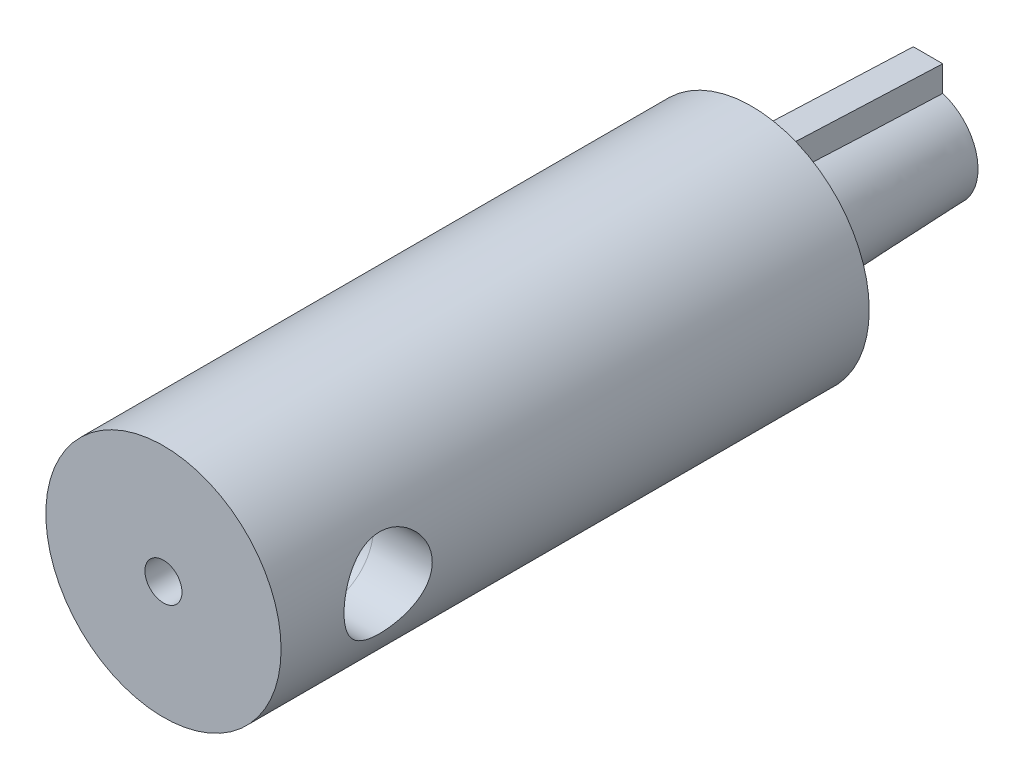
ISO-10303-21;
HEADER;
FILE_DESCRIPTION(('STEP AP214'),'2;1');
FILE_NAME('part.step','',(''),(''),'','','');
FILE_SCHEMA(('AUTOMOTIVE_DESIGN { 1 0 10303 214 1 1 1 1 }'));
ENDSEC;
DATA;
#1=APPLICATION_CONTEXT('core data for automotive mechanical design processes');
#2=APPLICATION_PROTOCOL_DEFINITION('international standard','automotive_design',2000,#1);
#3=PRODUCT_CONTEXT('',#1,'mechanical');
#4=PRODUCT('Part','Part','',(#3));
#5=PRODUCT_RELATED_PRODUCT_CATEGORY('part','',(#4));
#6=PRODUCT_DEFINITION_FORMATION('','',#4);
#7=PRODUCT_DEFINITION_CONTEXT('part definition',#1,'design');
#8=PRODUCT_DEFINITION('design','',#6,#7);
#9=PRODUCT_DEFINITION_SHAPE('','',#8);
#10=(LENGTH_UNIT() NAMED_UNIT(*) SI_UNIT(.MILLI.,.METRE.));
#11=(NAMED_UNIT(*) PLANE_ANGLE_UNIT() SI_UNIT($,.RADIAN.));
#12=(NAMED_UNIT(*) SI_UNIT($,.STERADIAN.) SOLID_ANGLE_UNIT());
#13=UNCERTAINTY_MEASURE_WITH_UNIT(LENGTH_MEASURE(1.E-05),#10,'distance_accuracy_value','');
#14=(GEOMETRIC_REPRESENTATION_CONTEXT(3) GLOBAL_UNCERTAINTY_ASSIGNED_CONTEXT((#13)) GLOBAL_UNIT_ASSIGNED_CONTEXT((#10,
#11,#12)) REPRESENTATION_CONTEXT('',''));
#15=CARTESIAN_POINT('',(0.,0.,0.));
#16=DIRECTION('',(0.,0.,1.));
#17=DIRECTION('',(1.,0.,0.));
#18=AXIS2_PLACEMENT_3D('',#15,#16,#17);
#19=CARTESIAN_POINT('',(3.30208634636661,-7.83238314698274,-30.));
#20=CARTESIAN_POINT('',(5.6762524053336,-7.92733616235268,0.));
#21=CARTESIAN_POINT('',(18.9668526403321,-1.22821045424952,-30.));
#22=CARTESIAN_POINT('',(21.530924730039,3.42516864831451,0.));
#23=CARTESIAN_POINT('',(12.3626799475989,14.436555839716,-30.));
#24=CARTESIAN_POINT('',(10.1784199193718,19.2798409730199,0.));
#25=CARTESIAN_POINT('',(-3.30208634636661,7.83238314698274,-30.));
#26=CARTESIAN_POINT('',(-5.6762524053336,7.92733616235268,0.));
#27=CARTESIAN_POINT('',(-18.9668526403321,1.22821045424951,-30.));
#28=CARTESIAN_POINT('',(-21.530924730039,-3.42516864831451,0.));
#29=CARTESIAN_POINT('',(-12.3626799475989,-14.436555839716,-30.));
#30=CARTESIAN_POINT('',(-10.1784199193718,-19.2798409730199,0.));
#31=CARTESIAN_POINT('',(3.30208634636661,-7.83238314698274,-30.));
#32=CARTESIAN_POINT('',(5.6762524053336,-7.92733616235268,0.));
#33=(BOUNDED_SURFACE() B_SPLINE_SURFACE(3,1,((#19,#20),(#21,#22),(#23,#24),(#25,#26),(#27,#28),
(#29,#30),(#31,#32)),.UNSPECIFIED.,.T.,.F.,.F.) B_SPLINE_SURFACE_WITH_KNOTS((4,3,4),(2,2),(0.,
0.5,1.),(0.,1.),.UNSPECIFIED.) GEOMETRIC_REPRESENTATION_ITEM() RATIONAL_B_SPLINE_SURFACE(((1.,
1.),(0.333333333333333,0.333333333333333),(0.333333333333333,0.333333333333333),(1.,1.),
(0.333333333333333,0.333333333333333),(0.333333333333333,0.333333333333333),(1.,1.))) REPRESENTATION_ITEM('') SURFACE());
#34=CARTESIAN_POINT('',(-9.41145667145274,-2.54695569678151,0.));
#35=CARTESIAN_POINT('',(-9.2880696524457,-2.4757181681433,-2.83135772601338));
#36=CARTESIAN_POINT('',(-9.1687625736273,-2.40683619407127,-5.66295938255184));
#37=CARTESIAN_POINT('',(-8.93959445864397,-2.27452592119596,-11.3266726984917));
#38=CARTESIAN_POINT('',(-8.82973342694787,-2.21109762497277,-14.1587843581338));
#39=CARTESIAN_POINT('',(-8.64526098561574,-2.1045924113116,-19.15898570479));
#40=CARTESIAN_POINT('',(-8.56842689083375,-2.06023222600628,-21.3269657384203));
#41=CARTESIAN_POINT('',(-8.42167777167353,-1.97550658255578,-25.6632449497094));
#42=CARTESIAN_POINT('',(-8.3517627708245,-1.9351411379952,-27.8315441284285));
#43=CARTESIAN_POINT('',(-8.28562363973516,-1.8969556928568,-30.));
#44=B_SPLINE_CURVE_WITH_KNOTS('',3,(#34,#35,#36,#37,#38,#39,#40,#41,#42,#43),.UNSPECIFIED.,.F.,
.F.,(4,2,2,2,4),(0.,8.5048271624319,17.0096583484011,23.5190281215728,30.0284200298795),.UNSPECIFIED.);
#45=CARTESIAN_POINT('',(-9.41145667145274,-2.54695569678151,0.));
#46=VERTEX_POINT('',#45);
#47=CARTESIAN_POINT('',(-8.28562460028441,-1.89695591273358,-30.));
#48=VERTEX_POINT('',#47);
#49=EDGE_CURVE('E12',#46,#48,#44,.T.);
#50=CARTESIAN_POINT('',(0.,0.,0.));
#51=DIRECTION('',(0.,0.,-1.));
#52=DIRECTION('',(-1.,0.,0.));
#53=AXIS2_PLACEMENT_3D('',#50,#51,#52);
#54=CIRCLE('',#53,9.75);
#55=CARTESIAN_POINT('',(-2.5,9.42403841248538,0.));
#56=VERTEX_POINT('',#55);
#57=EDGE_CURVE('E371',#46,#56,#54,.T.);
#58=CARTESIAN_POINT('',(-2.5,8.12403840463597,-29.9999999999999));
#59=CARTESIAN_POINT('',(-2.50000000000011,8.2238309010352,-27.1668030299867));
#60=CARTESIAN_POINT('',(-2.50000000000006,8.33105010057489,-24.3338753056638));
#61=CARTESIAN_POINT('',(-2.49999999999993,8.55874924063093,-18.6685535280623));
#62=CARTESIAN_POINT('',(-2.49999999999985,8.6792291720726,-15.8361594744197));
#63=CARTESIAN_POINT('',(-2.49999999999988,8.90222062843687,-10.8363895040832));
#64=CARTESIAN_POINT('',(-2.49999999999995,9.00231564568361,-8.66890486456372));
#65=CARTESIAN_POINT('',(-2.50000000000005,9.20869572257075,-4.33423326601074));
#66=CARTESIAN_POINT('',(-2.50000000000008,9.31498077289041,-2.16704630653393));
#67=CARTESIAN_POINT('',(-2.5,9.42403841248538,0.));
#68=B_SPLINE_CURVE_WITH_KNOTS('',3,(#58,#59,#60,#61,#62,#63,#64,#65,#66,#67),.UNSPECIFIED.,.F.,
.F.,(4,2,2,2,4),(0.,8.50484125893351,17.0096766978059,23.5190522242231,30.0284179493096),.UNSPECIFIED.);
#69=CARTESIAN_POINT('',(-2.49999976575404,8.12403764358966,-30.));
#70=VERTEX_POINT('',#69);
#71=EDGE_CURVE('E379',#70,#56,#68,.T.);
#72=CARTESIAN_POINT('',(0.,0.,-30.));
#73=DIRECTION('',(0.,0.,1.));
#74=DIRECTION('',(1.,0.,0.));
#75=AXIS2_PLACEMENT_3D('',#72,#73,#74);
#76=CIRCLE('',#75,8.5);
#77=EDGE_CURVE('E326',#70,#48,#76,.T.);
#78=ORIENTED_EDGE('',*,*,#49,.F.);
#79=ORIENTED_EDGE('',*,*,#57,.T.);
#80=ORIENTED_EDGE('',*,*,#71,.F.);
#81=ORIENTED_EDGE('',*,*,#77,.T.);
#82=EDGE_LOOP('',(#78,#79,#80,#81));
#83=FACE_BOUND('',#82,.T.);
#84=ADVANCED_FACE('F53',(#83),#33,.T.);
#85=CARTESIAN_POINT('',(0.,0.,100.));
#86=DIRECTION('',(0.,0.,-1.));
#87=DIRECTION('',(-1.,0.,0.));
#88=AXIS2_PLACEMENT_3D('',#85,#86,#87);
#89=CYLINDRICAL_SURFACE('',#88,20.);
#90=CARTESIAN_POINT('',(0.,0.,100.));
#91=DIRECTION('',(0.,0.,1.));
#92=DIRECTION('',(1.,0.,0.));
#93=AXIS2_PLACEMENT_3D('',#90,#91,#92);
#94=CIRCLE('',#93,20.);
#95=CARTESIAN_POINT('',(20.,0.,100.));
#96=VERTEX_POINT('',#95);
#97=EDGE_CURVE('E421',#96,#96,#94,.T.);
#98=ORIENTED_EDGE('',*,*,#97,.F.);
#99=EDGE_LOOP('',(#98));
#100=FACE_BOUND('',#99,.T.);
#101=CARTESIAN_POINT('',(0.,0.,0.));
#102=DIRECTION('',(0.,0.,1.));
#103=DIRECTION('',(1.,0.,0.));
#104=AXIS2_PLACEMENT_3D('',#101,#102,#103);
#105=CIRCLE('',#104,20.);
#106=CARTESIAN_POINT('',(20.,0.,0.));
#107=VERTEX_POINT('',#106);
#108=EDGE_CURVE('E419',#107,#107,#105,.T.);
#109=ORIENTED_EDGE('',*,*,#108,.T.);
#110=EDGE_LOOP('',(#109));
#111=FACE_BOUND('',#110,.T.);
#112=CARTESIAN_POINT('',(20.,0.,74.2938834486489));
#113=CARTESIAN_POINT('',(20.0000006949911,0.203070968021459,74.2938825011936));
#114=CARTESIAN_POINT('',(19.9969005176281,0.406128872036972,74.3021372739096));
#115=CARTESIAN_POINT('',(19.9845861075051,0.810722493053342,74.3350686721892));
#116=CARTESIAN_POINT('',(19.9753719932571,1.01225823948296,74.3597449794395));
#117=CARTESIAN_POINT('',(19.9510804699548,1.41228165684716,74.4252652052667));
#118=CARTESIAN_POINT('',(19.9360041221055,1.61076987270177,74.4661061976716));
#119=CARTESIAN_POINT('',(19.9003893947718,2.00333465937662,74.5635616330823));
#120=CARTESIAN_POINT('',(19.8798508703887,2.19741111301496,74.6201764945335));
#121=CARTESIAN_POINT('',(19.8338980424643,2.57942334484994,74.7485238813045));
#122=CARTESIAN_POINT('',(19.8084943914583,2.76737150814739,74.8202234108822));
#123=CARTESIAN_POINT('',(19.7534187407954,3.13644330297231,74.9782370976797));
#124=CARTESIAN_POINT('',(19.7237452567773,3.31756453344304,75.0645563391395));
#125=CARTESIAN_POINT('',(19.6608785037209,3.67181392735243,75.2511124295837));
#126=CARTESIAN_POINT('',(19.6276857148228,3.84494317652612,75.3513473806179));
#127=CARTESIAN_POINT('',(19.5585744043947,4.18232397222971,75.5650745947781));
#128=CARTESIAN_POINT('',(19.5226549005367,4.34657228246888,75.6785716437325));
#129=CARTESIAN_POINT('',(19.4475600773382,4.67132012701298,75.9226330219386));
#130=CARTESIAN_POINT('',(19.4083128458309,4.83143819793328,76.0536829700604));
#131=CARTESIAN_POINT('',(19.328838303106,5.14017756215578,76.3284211117974));
#132=CARTESIAN_POINT('',(19.2886109633058,5.28879851964385,76.4721096743065));
#133=CARTESIAN_POINT('',(19.2082062022255,5.57375496212915,76.771338402275));
#134=CARTESIAN_POINT('',(19.1680288125827,5.71008474111935,76.9268840109929));
#135=CARTESIAN_POINT('',(19.0888249186339,5.96951895886719,77.2488237377724));
#136=CARTESIAN_POINT('',(19.0497980301105,6.09262784997175,77.4152141731386));
#137=CARTESIAN_POINT('',(18.9724859555749,6.32936647954693,77.7645731589389));
#138=CARTESIAN_POINT('',(18.9342875038848,6.44244711735878,77.9479336658511));
#139=CARTESIAN_POINT('',(18.8614640429767,6.65263459332164,78.3241763915298));
#140=CARTESIAN_POINT('',(18.826837602539,6.74974783856143,78.5170547505649));
#141=CARTESIAN_POINT('',(18.7622651010258,6.92721666163355,78.9111145899574));
#142=CARTESIAN_POINT('',(18.732318593607,7.00757383780174,79.1122952761735));
#143=CARTESIAN_POINT('',(18.6781264228347,7.1507665901449,79.5215442571735));
#144=CARTESIAN_POINT('',(18.6538804250933,7.21360319410448,79.7296121471418));
#145=CARTESIAN_POINT('',(18.6128171932609,7.3188864092305,80.1424010878224));
#146=CARTESIAN_POINT('',(18.5957361566855,7.36206332770832,80.3469096454774));
#147=CARTESIAN_POINT('',(18.5682025890409,7.43123437452077,80.7592563383945));
#148=CARTESIAN_POINT('',(18.5577498877569,7.4572289440963,80.9670943880152));
#149=CARTESIAN_POINT('',(18.5438461337811,7.49173666070089,81.3843766904721));
#150=CARTESIAN_POINT('',(18.5403925915472,7.50025602352703,81.5938203455907));
#151=CARTESIAN_POINT('',(18.5406045750876,7.49973228101478,82.0126779142968));
#152=CARTESIAN_POINT('',(18.5442698247326,7.49068985687681,82.2220918287227));
#153=CARTESIAN_POINT('',(18.5581541826773,7.45622070727225,82.6266357949813));
#154=CARTESIAN_POINT('',(18.5679659887167,7.43181178035891,82.8218676270276));
#155=CARTESIAN_POINT('',(18.5934550735589,7.36780931755873,83.2095063094472));
#156=CARTESIAN_POINT('',(18.6091343980122,7.32821048574541,83.4019121502259));
#157=CARTESIAN_POINT('',(18.6458755071589,7.23421503229473,83.7824869262937));
#158=CARTESIAN_POINT('',(18.6669358543613,7.17982236244592,83.9706569785499));
#159=CARTESIAN_POINT('',(18.7138316388318,7.05668780060369,84.3417028520011));
#160=CARTESIAN_POINT('',(18.7396689024681,6.98794041903922,84.5245766172199));
#161=CARTESIAN_POINT('',(18.7959041471208,6.83525595221402,84.8872142462722));
#162=CARTESIAN_POINT('',(18.8263777414694,6.75106109551286,85.0668577612196));
#163=CARTESIAN_POINT('',(18.8906847573172,6.56896880176203,85.4185031761953));
#164=CARTESIAN_POINT('',(18.9245193195636,6.47106670768666,85.5905024528234));
#165=CARTESIAN_POINT('',(18.9946467838013,6.26222988156312,85.925893454014));
#166=CARTESIAN_POINT('',(19.0309399609969,6.15129368952391,86.0892842113338));
#167=CARTESIAN_POINT('',(19.1050600058862,5.91707432475699,86.4065965981358));
#168=CARTESIAN_POINT('',(19.1428869428418,5.79379059406597,86.5605177991976));
#169=CARTESIAN_POINT('',(19.2217192251952,5.52685758549759,86.8681383312753));
#170=CARTESIAN_POINT('',(19.2627668694648,5.38239554850842,87.0211225300534));
#171=CARTESIAN_POINT('',(19.3444196466276,5.08111960259879,87.3144278915546));
#172=CARTESIAN_POINT('',(19.3850249099682,4.9243094535767,87.4547528811928));
#173=CARTESIAN_POINT('',(19.4647378562275,4.59913178437368,87.7219771706626));
#174=CARTESIAN_POINT('',(19.5038447299098,4.4307581524274,87.8488692792245));
#175=CARTESIAN_POINT('',(19.5794735643872,4.08359626326275,88.0882202266966));
#176=CARTESIAN_POINT('',(19.6159965527517,3.90481219826151,88.2006848178338));
#177=CARTESIAN_POINT('',(19.6860423205742,3.53492899562548,88.4120681535395));
#178=CARTESIAN_POINT('',(19.7195078794209,3.34367879554688,88.5107419190484));
#179=CARTESIAN_POINT('',(19.7818042347176,2.95285527289817,88.6914900333154));
#180=CARTESIAN_POINT('',(19.8106369862409,2.75328550625454,88.7735713879671));
#181=CARTESIAN_POINT('',(19.8628434264484,2.34719996217688,88.9204015192833));
#182=CARTESIAN_POINT('',(19.8862178749036,2.14068515604437,88.9851527084115));
#183=CARTESIAN_POINT('',(19.9268153054777,1.72226565642152,89.0966685223494));
#184=CARTESIAN_POINT('',(19.9440386557731,1.5103612863393,89.1434342237007));
#185=CARTESIAN_POINT('',(19.9710730258303,1.09424775972726,89.2164734938672));
#186=CARTESIAN_POINT('',(19.9812295417902,0.890228709079153,89.2437046257716));
#187=CARTESIAN_POINT('',(19.9952797490968,0.480429861153437,89.2813075022969));
#188=CARTESIAN_POINT('',(19.9991736625905,0.274650126591165,89.2916798449332));
#189=CARTESIAN_POINT('',(20.0005896492051,-0.137045616648888,89.2954558724119));
#190=CARTESIAN_POINT('',(19.9981129628774,-0.342961590989924,89.2888628609298));
#191=CARTESIAN_POINT('',(19.9868596574388,-0.75337984881987,89.2587848997777));
#192=CARTESIAN_POINT('',(19.9780831342252,-0.957882153780105,89.2353002072363));
#193=CARTESIAN_POINT('',(19.9549324504254,-1.35605980169529,89.1729165954862));
#194=CARTESIAN_POINT('',(19.9407879695859,-1.54984794134557,89.1346491234203));
#195=CARTESIAN_POINT('',(19.9072569807347,-1.93344269290831,89.0430693283587));
#196=CARTESIAN_POINT('',(19.887868626756,-2.1232478773237,88.9897517070662));
#197=CARTESIAN_POINT('',(19.8443406080703,-2.49752579570185,88.8685600525246));
#198=CARTESIAN_POINT('',(19.8202022917965,-2.68200002602577,88.8006901499308));
#199=CARTESIAN_POINT('',(19.7677484774414,-3.04461799000738,88.6509090496575));
#200=CARTESIAN_POINT('',(19.7394313942141,-3.22275928941149,88.5689925217043));
#201=CARTESIAN_POINT('',(19.6784277420874,-3.57668241852781,88.3891754419566));
#202=CARTESIAN_POINT('',(19.6456382523032,-3.75224591151486,88.2908801609634));
#203=CARTESIAN_POINT('',(19.5771555886676,-4.09456511700747,88.0807655174246));
#204=CARTESIAN_POINT('',(19.5414614186652,-4.26131777525404,87.9689415087907));
#205=CARTESIAN_POINT('',(19.4680439258145,-4.58506525872597,87.7325162883983));
#206=CARTESIAN_POINT('',(19.4303203062301,-4.74205864972659,87.6079132057198));
#207=CARTESIAN_POINT('',(19.3537631643409,-5.04542669379828,87.3466971694549));
#208=CARTESIAN_POINT('',(19.3149296015203,-5.19180095855238,87.2100837770827));
#209=CARTESIAN_POINT('',(19.2348304666649,-5.4813462403016,86.9173256371552));
#210=CARTESIAN_POINT('',(19.1935550246388,-5.62383372222469,86.7605066744072));
#211=CARTESIAN_POINT('',(19.1119813103232,-5.89510225689365,86.4352836362986));
#212=CARTESIAN_POINT('',(19.071682729132,-6.02388768732424,86.2668832895691));
#213=CARTESIAN_POINT('',(18.9931802921809,-6.26701151435384,85.9193600322703));
#214=CARTESIAN_POINT('',(18.9549774947293,-6.38134264929433,85.7402317982143));
#215=CARTESIAN_POINT('',(18.881842233177,-6.59459943128484,85.3724887289153));
#216=CARTESIAN_POINT('',(18.8469083964192,-6.69353155615769,85.1838779270717));
#217=CARTESIAN_POINT('',(18.7812317544015,-6.87566403749446,84.7973959804677));
#218=CARTESIAN_POINT('',(18.7505091923228,-6.95878910381581,84.5994858541344));
#219=CARTESIAN_POINT('',(18.694480634226,-7.10793535121494,84.1966649688911));
#220=CARTESIAN_POINT('',(18.6691723687546,-7.17396370099289,83.9917571850453));
#221=CARTESIAN_POINT('',(18.6248465673625,-7.28826820106416,83.5764429068598));
#222=CARTESIAN_POINT('',(18.6058271216825,-7.33654974112424,83.3660381028109));
#223=CARTESIAN_POINT('',(18.5747639414794,-7.41484504718195,82.9413522612139));
#224=CARTESIAN_POINT('',(18.5627197204411,-7.44486008725788,82.7270714950858));
#225=CARTESIAN_POINT('',(18.5465933049917,-7.48493863022116,82.3102824551219));
#226=CARTESIAN_POINT('',(18.5420491539834,-7.4961604056798,82.1079026474111));
#227=CARTESIAN_POINT('',(18.5396138019941,-7.5021819174978,81.7028610146104));
#228=CARTESIAN_POINT('',(18.5417223790381,-7.49698220177711,81.5001991991556));
#229=CARTESIAN_POINT('',(18.5525209844085,-7.4702189157973,81.0961592525601));
#230=CARTESIAN_POINT('',(18.5612103739758,-7.44865693372293,80.8947809987448));
#231=CARTESIAN_POINT('',(18.5848804234321,-7.38940016534892,80.4947908378965));
#232=CARTESIAN_POINT('',(18.5998610789405,-7.35170539028268,80.2961789289373));
#233=CARTESIAN_POINT('',(18.6350757989785,-7.26196897505606,79.9091982990506));
#234=CARTESIAN_POINT('',(18.655133955521,-7.21040468493111,79.7207024642879));
#235=CARTESIAN_POINT('',(18.7001191111151,-7.09291899633679,79.3487758547288));
#236=CARTESIAN_POINT('',(18.7250477129692,-7.02699287074365,79.1653467700793));
#237=CARTESIAN_POINT('',(18.7790659217203,-6.88133055609669,78.8047213581384));
#238=CARTESIAN_POINT('',(18.8081548517944,-6.80159661292323,78.6275240228659));
#239=CARTESIAN_POINT('',(18.8697152850299,-6.62889488784757,78.2802804431833));
#240=CARTESIAN_POINT('',(18.9021880991186,-6.53592197197538,78.1102370062944));
#241=CARTESIAN_POINT('',(19.0069536143875,-6.2277137240126,77.5949563578366));
#242=CARTESIAN_POINT('',(19.0836670851801,-5.99071861556498,77.2633181287321));
#243=CARTESIAN_POINT('',(19.2403301804045,-5.46664728657928,76.643086951488));
#244=CARTESIAN_POINT('',(19.3202808271434,-5.17955514905406,76.3545077384175));
#245=CARTESIAN_POINT('',(19.438676663767,-4.70809408633241,75.9518132678851));
#246=CARTESIAN_POINT('',(19.4788882496359,-4.53926103129734,75.8196777789076));
#247=CARTESIAN_POINT('',(19.55686920485,-4.19055225393182,75.5701237126359));
#248=CARTESIAN_POINT('',(19.5946394801554,-4.01068067682134,75.4526996606322));
#249=CARTESIAN_POINT('',(19.6667051020052,-3.6409088062972,75.2333937635382));
#250=CARTESIAN_POINT('',(19.7009985836445,-3.45100321297443,75.131520244886));
#251=CARTESIAN_POINT('',(19.7651027001156,-3.06258638682355,74.9442834146511));
#252=CARTESIAN_POINT('',(19.7949152332913,-2.86407884437145,74.8589131071087));
#253=CARTESIAN_POINT('',(19.8503942615567,-2.45094825989374,74.7020731372954));
#254=CARTESIAN_POINT('',(19.8758228421911,-2.23600002200006,74.6313733309101));
#255=CARTESIAN_POINT('',(19.9200461241093,-1.79994016793749,74.5095535387856));
#256=CARTESIAN_POINT('',(19.9388404924467,-1.57882824303678,74.4584345357231));
#257=CARTESIAN_POINT('',(19.969163307367,-1.13248745661206,74.3764083396845));
#258=CARTESIAN_POINT('',(19.9806948101893,-0.907260367875009,74.345492644879));
#259=CARTESIAN_POINT('',(19.9961123363293,-0.454683233786637,74.30423188976));
#260=CARTESIAN_POINT('',(19.9999992219729,-0.227333430788376,74.293884509304));
#261=CARTESIAN_POINT('',(20.,0.,74.2938834486489));
#262=B_SPLINE_CURVE_WITH_KNOTS('',3,(#112,#113,#114,#115,#116,#117,#118,#119,#120,#121,#122,
#123,#124,#125,#126,#127,#128,#129,#130,#131,#132,#133,#134,#135,#136,#137,#138,#139,#140,#141,
#142,#143,#144,#145,#146,#147,#148,#149,#150,#151,#152,#153,#154,#155,#156,#157,#158,#159,#160,
#161,#162,#163,#164,#165,#166,#167,#168,#169,#170,#171,#172,#173,#174,#175,#176,#177,#178,#179,
#180,#181,#182,#183,#184,#185,#186,#187,#188,#189,#190,#191,#192,#193,#194,#195,#196,#197,#198,
#199,#200,#201,#202,#203,#204,#205,#206,#207,#208,#209,#210,#211,#212,#213,#214,#215,#216,#217,
#218,#219,#220,#221,#222,#223,#224,#225,#226,#227,#228,#229,#230,#231,#232,#233,#234,#235,#236,
#237,#238,#239,#240,#241,#242,#243,#244,#245,#246,#247,#248,#249,#250,#251,#252,#253,#254,#255,
#256,#257,#258,#259,#260,#261),.UNSPECIFIED.,.T.,.F.,(4,2,2,2,2,2,2,2,2,2,2,2,2,2,2,2,2,2,2,2,2,
2,2,2,2,2,2,2,2,2,2,2,2,2,2,2,2,2,2,2,2,2,2,2,2,2,2,2,2,2,2,2,2,2,2,2,2,2,2,2,2,2,2,2,2,2,2,2,2,
2,2,2,2,2,4),(0.,0.608999956569121,1.2179881086895,1.82686607061669,2.43576018624771,
3.04333602101901,3.65112358554747,4.25882833580728,4.86675306673733,5.49784759802492,
6.12896055572049,6.76036500614003,7.39155614970225,8.04710389078631,8.70238794089193,
9.35760945582954,10.0127925263413,10.6411154155012,11.2694221687695,11.8975053993619,
12.5255642678541,13.1158609555577,13.706363636216,14.2967087341194,14.8872800083734,
15.48879042923,16.0905057110534,16.6922884573043,17.294098409327,17.9364976383173,
18.5787020128302,19.2212484699716,19.8635379434159,20.5160836111604,21.1683531732238,
21.8205318881423,22.4726715600923,23.0901283371345,23.7075632112555,24.3248778609402,
24.9421831139336,25.5356078324118,26.129241722893,26.7227073333315,27.3163986465876,
27.9273114640636,28.5384346823473,29.149647500183,29.760882657408,30.407730978247,
31.0543720122049,31.7013366304338,32.3480283535228,32.9977271255338,33.647153034297,
34.2963815469097,34.9455647710003,35.5530262644448,36.1604674895258,36.7678497615569,
37.375231610664,37.96391674576,38.5527959370655,39.1415794353244,39.7305918841889,
40.9691711455771,42.2081446512166,42.8618687687023,43.5153488822951,44.169177679639,
44.8227286983722,45.5048205241399,46.186946576693,46.8687853960765,47.5505472984583),.UNSPECIFIED.);
#263=CARTESIAN_POINT('',(20.,0.,74.2938834486489));
#264=VERTEX_POINT('',#263);
#265=EDGE_CURVE('E425',#264,#264,#262,.T.);
#266=ORIENTED_EDGE('',*,*,#265,.F.);
#267=EDGE_LOOP('',(#266));
#268=FACE_BOUND('',#267,.T.);
#269=ADVANCED_FACE('F55',(#100,#111,#268),#89,.T.);
#270=CARTESIAN_POINT('',(0.,0.,100.));
#271=DIRECTION('',(0.,0.,1.));
#272=DIRECTION('',(1.,0.,0.));
#273=AXIS2_PLACEMENT_3D('',#270,#271,#272);
#274=PLANE('',#273);
#275=CARTESIAN_POINT('',(0.,0.,100.));
#276=DIRECTION('',(0.,0.,1.));
#277=DIRECTION('',(1.,0.,0.));
#278=AXIS2_PLACEMENT_3D('',#275,#276,#277);
#279=CIRCLE('',#278,3.15);
#280=CARTESIAN_POINT('',(3.15,0.,100.));
#281=VERTEX_POINT('',#280);
#282=EDGE_CURVE('E428',#281,#281,#279,.T.);
#283=ORIENTED_EDGE('',*,*,#282,.F.);
#284=EDGE_LOOP('',(#283));
#285=FACE_BOUND('',#284,.T.);
#286=ORIENTED_EDGE('',*,*,#97,.T.);
#287=EDGE_LOOP('',(#286));
#288=FACE_BOUND('',#287,.T.);
#289=ADVANCED_FACE('F416',(#285,#288),#274,.T.);
#290=CARTESIAN_POINT('',(0.,0.,0.));
#291=DIRECTION('',(0.,0.,1.));
#292=DIRECTION('',(1.,0.,0.));
#293=AXIS2_PLACEMENT_3D('',#290,#291,#292);
#294=PLANE('',#293);
#295=ORIENTED_EDGE('',*,*,#57,.F.);
#296=DIRECTION('',(0.866025403784443,0.499999999999992,0.));
#297=VECTOR('',#296,1.);
#298=CARTESIAN_POINT('',(-13.1578493020361,-4.70993649053878,0.));
#299=LINE('',#298,#297);
#300=CARTESIAN_POINT('',(-13.1578493020361,-4.70993649053878,0.));
#301=VERTEX_POINT('',#300);
#302=EDGE_CURVE('E73',#301,#46,#299,.T.);
#303=ORIENTED_EDGE('',*,*,#302,.F.);
#304=DIRECTION('',(-0.499999999999992,0.866025403784443,0.));
#305=VECTOR('',#304,1.);
#306=CARTESIAN_POINT('',(-13.1578493020361,-4.70993649053878,0.));
#307=LINE('',#306,#305);
#308=CARTESIAN_POINT('',(-10.6578493020361,-9.040063509461,0.));
#309=VERTEX_POINT('',#308);
#310=EDGE_CURVE('E78',#309,#301,#307,.T.);
#311=ORIENTED_EDGE('',*,*,#310,.F.);
#312=DIRECTION('',(-0.866025403784443,-0.499999999999992,0.));
#313=VECTOR('',#312,1.);
#314=CARTESIAN_POINT('',(-10.6578493020361,-9.040063509461,0.));
#315=LINE('',#314,#313);
#316=CARTESIAN_POINT('',(-6.91145667145279,-6.87708271570373,0.));
#317=VERTEX_POINT('',#316);
#318=EDGE_CURVE('E155',#317,#309,#315,.T.);
#319=ORIENTED_EDGE('',*,*,#318,.F.);
#320=CARTESIAN_POINT('',(2.5,9.42403841248538,0.));
#321=VERTEX_POINT('',#320);
#322=EDGE_CURVE('E328',#321,#317,#54,.T.);
#323=ORIENTED_EDGE('',*,*,#322,.F.);
#324=DIRECTION('',(0.,-1.,0.));
#325=VECTOR('',#324,1.);
#326=CARTESIAN_POINT('',(2.5,13.75,0.));
#327=LINE('',#326,#325);
#328=CARTESIAN_POINT('',(2.5,13.75,0.));
#329=VERTEX_POINT('',#328);
#330=EDGE_CURVE('E295',#329,#321,#327,.T.);
#331=ORIENTED_EDGE('',*,*,#330,.F.);
#332=DIRECTION('',(1.,0.,0.));
#333=VECTOR('',#332,1.);
#334=CARTESIAN_POINT('',(2.5,13.75,0.));
#335=LINE('',#334,#333);
#336=CARTESIAN_POINT('',(-2.5,13.75,0.));
#337=VERTEX_POINT('',#336);
#338=EDGE_CURVE('E404',#337,#329,#335,.T.);
#339=ORIENTED_EDGE('',*,*,#338,.F.);
#340=DIRECTION('',(0.,1.,0.));
#341=VECTOR('',#340,1.);
#342=CARTESIAN_POINT('',(-2.5,13.75,0.));
#343=LINE('',#342,#341);
#344=EDGE_CURVE('E401',#56,#337,#343,.T.);
#345=ORIENTED_EDGE('',*,*,#344,.F.);
#346=EDGE_LOOP('',(#295,#303,#311,#319,#323,#331,#339,#345));
#347=FACE_BOUND('',#346,.T.);
#348=ORIENTED_EDGE('',*,*,#108,.F.);
#349=EDGE_LOOP('',(#348));
#350=FACE_BOUND('',#349,.T.);
#351=ADVANCED_FACE('F412',(#347,#350),#294,.F.);
#352=CARTESIAN_POINT('',(0.,0.,95.));
#353=DIRECTION('',(0.,0.,1.));
#354=DIRECTION('',(1.,0.,0.));
#355=AXIS2_PLACEMENT_3D('',#352,#353,#354);
#356=CYLINDRICAL_SURFACE('',#355,3.15);
#357=CARTESIAN_POINT('',(0.,0.,95.));
#358=DIRECTION('',(0.,0.,1.));
#359=DIRECTION('',(1.,0.,0.));
#360=AXIS2_PLACEMENT_3D('',#357,#358,#359);
#361=CIRCLE('',#360,3.15);
#362=CARTESIAN_POINT('',(3.15,0.,95.));
#363=VERTEX_POINT('',#362);
#364=EDGE_CURVE('E422',#363,#363,#361,.T.);
#365=ORIENTED_EDGE('',*,*,#364,.F.);
#366=EDGE_LOOP('',(#365));
#367=FACE_BOUND('',#366,.T.);
#368=ORIENTED_EDGE('',*,*,#282,.T.);
#369=EDGE_LOOP('',(#368));
#370=FACE_BOUND('',#369,.T.);
#371=ADVANCED_FACE('F415',(#367,#370),#356,.F.);
#372=CARTESIAN_POINT('',(0.,0.,95.));
#373=DIRECTION('',(0.,0.,1.));
#374=DIRECTION('',(1.,0.,0.));
#375=AXIS2_PLACEMENT_3D('',#372,#373,#374);
#376=PLANE('',#375);
#377=ORIENTED_EDGE('',*,*,#364,.T.);
#378=EDGE_LOOP('',(#377));
#379=FACE_BOUND('',#378,.T.);
#380=ADVANCED_FACE('F441',(#379),#376,.T.);
#381=CARTESIAN_POINT('',(9.99999999999999,0.,81.7938834486489));
#382=DIRECTION('',(1.,0.,0.));
#383=DIRECTION('',(0.,0.,-1.));
#384=AXIS2_PLACEMENT_3D('',#381,#382,#383);
#385=CYLINDRICAL_SURFACE('',#384,7.5);
#386=CARTESIAN_POINT('',(9.99999999999999,0.,81.7938834486489));
#387=DIRECTION('',(-1.,0.,0.));
#388=DIRECTION('',(0.,0.,1.));
#389=AXIS2_PLACEMENT_3D('',#386,#387,#388);
#390=CIRCLE('',#389,7.5);
#391=CARTESIAN_POINT('',(9.99999999999999,0.,89.2938834486489));
#392=VERTEX_POINT('',#391);
#393=EDGE_CURVE('E593',#392,#392,#390,.T.);
#394=ORIENTED_EDGE('',*,*,#393,.T.);
#395=EDGE_LOOP('',(#394));
#396=FACE_BOUND('',#395,.T.);
#397=ORIENTED_EDGE('',*,*,#265,.T.);
#398=EDGE_LOOP('',(#397));
#399=FACE_BOUND('',#398,.T.);
#400=ADVANCED_FACE('F435',(#396,#399),#385,.F.);
#401=CARTESIAN_POINT('',(10.,0.,71.7938834486489));
#402=DIRECTION('',(0.,1.,0.));
#403=DIRECTION('',(0.,0.,1.));
#404=AXIS2_PLACEMENT_3D('',#401,#402,#403);
#405=TOROIDAL_SURFACE('',#404,10.,7.5);
#406=CARTESIAN_POINT('',(0.,0.,71.7938834486489));
#407=DIRECTION('',(0.,0.,-1.));
#408=DIRECTION('',(-1.,0.,0.));
#409=AXIS2_PLACEMENT_3D('',#406,#407,#408);
#410=CIRCLE('',#409,7.5);
#411=CARTESIAN_POINT('',(-7.5,0.,71.7938834486489));
#412=VERTEX_POINT('',#411);
#413=EDGE_CURVE('E325',#412,#412,#410,.T.);
#414=CARTESIAN_POINT('',(10.,0.,71.7938834486489));
#415=DIRECTION('',(0.,1.,0.));
#416=DIRECTION('',(0.,0.,1.));
#417=AXIS2_PLACEMENT_3D('',#414,#415,#416);
#418=CIRCLE('',#417,17.5);
#419=EDGE_CURVE('',#412,#392,#418,.T.);
#420=ORIENTED_EDGE('',*,*,#413,.T.);
#421=ORIENTED_EDGE('',*,*,#393,.F.);
#422=ORIENTED_EDGE('',*,*,#419,.T.);
#423=ORIENTED_EDGE('',*,*,#419,.F.);
#424=EDGE_LOOP('',(#420,#422,#421,#423));
#425=FACE_BOUND('',#424,.T.);
#426=ADVANCED_FACE('F440',(#425),#405,.F.);
#427=CARTESIAN_POINT('',(0.,0.,71.7938834486489));
#428=DIRECTION('',(0.,0.,-1.));
#429=DIRECTION('',(-1.,0.,0.));
#430=AXIS2_PLACEMENT_3D('',#427,#428,#429);
#431=CYLINDRICAL_SURFACE('',#430,7.5);
#432=ORIENTED_EDGE('',*,*,#413,.F.);
#433=EDGE_LOOP('',(#432));
#434=FACE_BOUND('',#433,.T.);
#435=CARTESIAN_POINT('',(0.,0.,0.));
#436=DIRECTION('',(0.,0.,-1.));
#437=DIRECTION('',(-1.,0.,0.));
#438=AXIS2_PLACEMENT_3D('',#435,#436,#437);
#439=CIRCLE('',#438,7.5);
#440=CARTESIAN_POINT('',(-7.5,0.,0.));
#441=VERTEX_POINT('',#440);
#442=EDGE_CURVE('E322',#441,#441,#439,.F.);
#443=ORIENTED_EDGE('',*,*,#442,.F.);
#444=EDGE_LOOP('',(#443));
#445=FACE_BOUND('',#444,.T.);
#446=ADVANCED_FACE('F466',(#434,#445),#431,.F.);
#447=CARTESIAN_POINT('',(0.,0.,0.));
#448=DIRECTION('',(0.,0.,-1.));
#449=DIRECTION('',(-1.,0.,0.));
#450=AXIS2_PLACEMENT_3D('',#447,#448,#449);
#451=PLANE('',#450);
#452=CARTESIAN_POINT('',(0.,0.,0.));
#453=DIRECTION('',(0.,0.,-1.));
#454=DIRECTION('',(-1.,0.,0.));
#455=AXIS2_PLACEMENT_3D('',#452,#453,#454);
#456=CIRCLE('',#455,4.);
#457=CARTESIAN_POINT('',(-4.,0.,0.));
#458=VERTEX_POINT('',#457);
#459=EDGE_CURVE('E251',#458,#458,#456,.T.);
#460=ORIENTED_EDGE('',*,*,#459,.T.);
#461=EDGE_LOOP('',(#460));
#462=FACE_BOUND('',#461,.T.);
#463=ORIENTED_EDGE('',*,*,#442,.T.);
#464=EDGE_LOOP('',(#463));
#465=FACE_BOUND('',#464,.T.);
#466=ADVANCED_FACE('F198',(#462,#465),#451,.F.);
#467=CARTESIAN_POINT('',(0.,0.,-30.));
#468=DIRECTION('',(0.,0.,1.));
#469=DIRECTION('',(1.,0.,0.));
#470=AXIS2_PLACEMENT_3D('',#467,#468,#469);
#471=PLANE('',#470);
#472=DIRECTION('',(-0.866025403784443,-0.499999999999992,0.));
#473=VECTOR('',#472,1.);
#474=CARTESIAN_POINT('',(-6.24196809114377,-0.717050611746719,-30.));
#475=LINE('',#474,#473);
#476=CARTESIAN_POINT('',(-12.0753175473055,-4.08493649053879,-30.));
#477=VERTEX_POINT('',#476);
#478=EDGE_CURVE('E150',#48,#477,#475,.T.);
#479=ORIENTED_EDGE('',*,*,#478,.F.);
#480=ORIENTED_EDGE('',*,*,#77,.F.);
#481=DIRECTION('',(0.,-1.,0.));
#482=VECTOR('',#481,1.);
#483=CARTESIAN_POINT('',(-2.5,5.76422824241575,-30.));
#484=LINE('',#483,#482);
#485=CARTESIAN_POINT('',(-2.5,12.5,-30.));
#486=VERTEX_POINT('',#485);
#487=EDGE_CURVE('E229',#486,#70,#484,.T.);
#488=ORIENTED_EDGE('',*,*,#487,.F.);
#489=DIRECTION('',(-1.,0.,0.));
#490=VECTOR('',#489,1.);
#491=CARTESIAN_POINT('',(2.5,12.5,-30.));
#492=LINE('',#491,#490);
#493=CARTESIAN_POINT('',(2.5,12.5,-30.));
#494=VERTEX_POINT('',#493);
#495=EDGE_CURVE('E234',#494,#486,#492,.T.);
#496=ORIENTED_EDGE('',*,*,#495,.F.);
#497=DIRECTION('',(0.,1.,0.));
#498=VECTOR('',#497,1.);
#499=CARTESIAN_POINT('',(2.5,5.76422824241575,-30.));
#500=LINE('',#499,#498);
#501=CARTESIAN_POINT('',(2.50000026456095,8.12403926461017,-30.));
#502=VERTEX_POINT('',#501);
#503=EDGE_CURVE('E235',#502,#494,#500,.T.);
#504=ORIENTED_EDGE('',*,*,#503,.F.);
#505=CARTESIAN_POINT('',(-5.78562430356648,-6.22708342632768,-30.));
#506=VERTEX_POINT('',#505);
#507=EDGE_CURVE('E135',#506,#502,#76,.T.);
#508=ORIENTED_EDGE('',*,*,#507,.F.);
#509=DIRECTION('',(0.866025403784443,0.499999999999992,0.));
#510=VECTOR('',#509,1.);
#511=CARTESIAN_POINT('',(-3.74196809114381,-5.04717763066894,-30.));
#512=LINE('',#511,#510);
#513=CARTESIAN_POINT('',(-9.57531754730556,-8.41506350946101,-30.));
#514=VERTEX_POINT('',#513);
#515=EDGE_CURVE('E125',#514,#506,#512,.T.);
#516=ORIENTED_EDGE('',*,*,#515,.F.);
#517=DIRECTION('',(0.499999999999992,-0.866025403784443,0.));
#518=VECTOR('',#517,1.);
#519=CARTESIAN_POINT('',(-12.0753175473055,-4.08493649053879,-30.));
#520=LINE('',#519,#518);
#521=EDGE_CURVE('E131',#477,#514,#520,.T.);
#522=ORIENTED_EDGE('',*,*,#521,.F.);
#523=EDGE_LOOP('',(#479,#480,#488,#496,#504,#508,#516,#522));
#524=FACE_BOUND('',#523,.T.);
#525=CARTESIAN_POINT('',(0.,0.,-30.));
#526=DIRECTION('',(0.,0.,-1.));
#527=DIRECTION('',(-1.,0.,0.));
#528=AXIS2_PLACEMENT_3D('',#525,#526,#527);
#529=CIRCLE('',#528,4.);
#530=CARTESIAN_POINT('',(-4.,0.,-30.));
#531=VERTEX_POINT('',#530);
#532=EDGE_CURVE('E407',#531,#531,#529,.T.);
#533=ORIENTED_EDGE('',*,*,#532,.F.);
#534=EDGE_LOOP('',(#533));
#535=FACE_BOUND('',#534,.T.);
#536=ADVANCED_FACE('F129',(#524,#535),#471,.F.);
#537=CARTESIAN_POINT('',(-5.78562363973521,-6.22708271177903,-29.9999999999999));
#538=CARTESIAN_POINT('',(-5.87204647672405,-6.27697895997864,-27.1668030299867));
#539=CARTESIAN_POINT('',(-5.96490102729885,-6.33058855974847,-24.3338753056638));
#540=CARTESIAN_POINT('',(-6.16209426700722,-6.44443812977648,-18.6685535280623));
#541=CARTESIAN_POINT('',(-6.26643294828188,-6.50467809549731,-15.8361594744197));
#542=CARTESIAN_POINT('',(-6.45954921432023,-6.61617382367945,-10.8363895040832));
#543=CARTESIAN_POINT('',(-6.54623404204817,-6.66622133230284,-8.66890486456371));
#544=CARTESIAN_POINT('',(-6.72496443146744,-6.76941137074641,-4.33423326601074));
#545=CARTESIAN_POINT('',(-6.81700998508679,-6.82255389590623,-2.16704630653394));
#546=CARTESIAN_POINT('',(-6.91145667145281,-6.87708271570369,0.));
#547=B_SPLINE_CURVE_WITH_KNOTS('',3,(#537,#538,#539,#540,#541,#542,#543,#544,#545,#546),
.UNSPECIFIED.,.F.,.F.,(4,2,2,2,4),(0.,8.50484125893351,17.0096766978059,23.5190522242232,
30.0284179493096),.UNSPECIFIED.);
#548=EDGE_CURVE('E65',#506,#317,#547,.T.);
#549=CARTESIAN_POINT('',(2.5,9.42403841248538,0.));
#550=CARTESIAN_POINT('',(2.5,9.28156335520895,-2.83135772601338));
#551=CARTESIAN_POINT('',(2.5,9.14379940706489,-5.66295938255184));
#552=CARTESIAN_POINT('',(2.5,8.87917886131428,-11.3266726984917));
#553=CARTESIAN_POINT('',(2.5,8.7523222688679,-14.1587843581338));
#554=CARTESIAN_POINT('',(2.5,8.53931184154554,-19.15898570479));
#555=CARTESIAN_POINT('',(2.5,8.4505914709349,-21.3269657384203));
#556=CARTESIAN_POINT('',(2.5,8.2811401840339,-25.6632449497094));
#557=CARTESIAN_POINT('',(2.50000000000001,8.20040929491275,-27.8315441284285));
#558=CARTESIAN_POINT('',(2.50000000000003,8.12403840463595,-30.));
#559=B_SPLINE_CURVE_WITH_KNOTS('',3,(#549,#550,#551,#552,#553,#554,#555,#556,#557,#558),
.UNSPECIFIED.,.F.,.F.,(4,2,2,2,4),(0.,8.5048271624319,17.0096583484011,23.5190281215728,
30.0284200298795),.UNSPECIFIED.);
#560=EDGE_CURVE('E228',#321,#502,#559,.T.);
#561=ORIENTED_EDGE('',*,*,#548,.F.);
#562=ORIENTED_EDGE('',*,*,#507,.T.);
#563=ORIENTED_EDGE('',*,*,#560,.F.);
#564=ORIENTED_EDGE('',*,*,#322,.T.);
#565=EDGE_LOOP('',(#561,#562,#563,#564));
#566=FACE_BOUND('',#565,.T.);
#567=ADVANCED_FACE('F188',(#566),#33,.T.);
#568=CARTESIAN_POINT('',(0.,0.,0.));
#569=DIRECTION('',(0.,0.,-1.));
#570=DIRECTION('',(-1.,0.,0.));
#571=AXIS2_PLACEMENT_3D('',#568,#569,#570);
#572=CYLINDRICAL_SURFACE('',#571,4.);
#573=ORIENTED_EDGE('',*,*,#459,.F.);
#574=EDGE_LOOP('',(#573));
#575=FACE_BOUND('',#574,.T.);
#576=ORIENTED_EDGE('',*,*,#532,.T.);
#577=EDGE_LOOP('',(#576));
#578=FACE_BOUND('',#577,.T.);
#579=ADVANCED_FACE('F194',(#575,#578),#572,.F.);
#580=CARTESIAN_POINT('',(2.5,0.,0.));
#581=DIRECTION('',(1.,0.,0.));
#582=DIRECTION('',(0.,0.,-1.));
#583=AXIS2_PLACEMENT_3D('',#580,#581,#582);
#584=PLANE('',#583);
#585=ORIENTED_EDGE('',*,*,#330,.T.);
#586=ORIENTED_EDGE('',*,*,#560,.T.);
#587=ORIENTED_EDGE('',*,*,#503,.T.);
#588=DIRECTION('',(0.,-0.0416305447121812,-0.999133073092352));
#589=VECTOR('',#588,1.);
#590=CARTESIAN_POINT('',(2.5,13.75,0.));
#591=LINE('',#590,#589);
#592=EDGE_CURVE('E292',#329,#494,#591,.T.);
#593=ORIENTED_EDGE('',*,*,#592,.F.);
#594=EDGE_LOOP('',(#585,#586,#587,#593));
#595=FACE_BOUND('',#594,.T.);
#596=ADVANCED_FACE('F176',(#595),#584,.T.);
#597=CARTESIAN_POINT('',(0.,13.7261698440208,-0.571923743500866));
#598=DIRECTION('',(0.,0.999133073092352,-0.0416305447121813));
#599=DIRECTION('',(0.,0.0416305447121813,0.999133073092352));
#600=AXIS2_PLACEMENT_3D('',#597,#598,#599);
#601=PLANE('',#600);
#602=ORIENTED_EDGE('',*,*,#592,.T.);
#603=ORIENTED_EDGE('',*,*,#495,.T.);
#604=DIRECTION('',(0.,-0.0416305447121812,-0.999133073092352));
#605=VECTOR('',#604,1.);
#606=CARTESIAN_POINT('',(-2.5,13.75,0.));
#607=LINE('',#606,#605);
#608=EDGE_CURVE('E233',#337,#486,#607,.T.);
#609=ORIENTED_EDGE('',*,*,#608,.F.);
#610=ORIENTED_EDGE('',*,*,#338,.T.);
#611=EDGE_LOOP('',(#602,#603,#609,#610));
#612=FACE_BOUND('',#611,.T.);
#613=ADVANCED_FACE('F264',(#612),#601,.T.);
#614=CARTESIAN_POINT('',(-2.5,0.,0.));
#615=DIRECTION('',(-1.,0.,0.));
#616=DIRECTION('',(0.,-1.,0.));
#617=AXIS2_PLACEMENT_3D('',#614,#615,#616);
#618=PLANE('',#617);
#619=ORIENTED_EDGE('',*,*,#487,.T.);
#620=ORIENTED_EDGE('',*,*,#71,.T.);
#621=ORIENTED_EDGE('',*,*,#344,.T.);
#622=ORIENTED_EDGE('',*,*,#608,.T.);
#623=EDGE_LOOP('',(#619,#620,#621,#622));
#624=FACE_BOUND('',#623,.T.);
#625=ADVANCED_FACE('F272',(#624),#618,.T.);
#626=CARTESIAN_POINT('',(-1.24999999999998,2.16506350946111,0.));
#627=DIRECTION('',(-0.499999999999992,0.866025403784443,0.));
#628=DIRECTION('',(0.,0.,-1.));
#629=AXIS2_PLACEMENT_3D('',#626,#627,#628);
#630=PLANE('',#629);
#631=ORIENTED_EDGE('',*,*,#302,.T.);
#632=ORIENTED_EDGE('',*,*,#49,.T.);
#633=ORIENTED_EDGE('',*,*,#478,.T.);
#634=DIRECTION('',(0.0360531092941331,0.0208152723560903,-0.999133073092352));
#635=VECTOR('',#634,1.);
#636=CARTESIAN_POINT('',(-13.1578493020361,-4.70993649053878,0.));
#637=LINE('',#636,#635);
#638=EDGE_CURVE('E149',#301,#477,#637,.T.);
#639=ORIENTED_EDGE('',*,*,#638,.F.);
#640=EDGE_LOOP('',(#631,#632,#633,#639));
#641=FACE_BOUND('',#640,.T.);
#642=ADVANCED_FACE('F276',(#641),#630,.T.);
#643=CARTESIAN_POINT('',(-11.887211781582,-6.86308492201029,-0.571923743500866));
#644=DIRECTION('',(-0.865274623059196,-0.499566536546168,-0.0416305447121813));
#645=DIRECTION('',(-0.0360531092941331,-0.0208152723560903,0.999133073092352));
#646=AXIS2_PLACEMENT_3D('',#643,#644,#645);
#647=PLANE('',#646);
#648=ORIENTED_EDGE('',*,*,#638,.T.);
#649=ORIENTED_EDGE('',*,*,#521,.T.);
#650=DIRECTION('',(0.0360531092941331,0.0208152723560903,-0.999133073092352));
#651=VECTOR('',#650,1.);
#652=CARTESIAN_POINT('',(-10.6578493020361,-9.040063509461,0.));
#653=LINE('',#652,#651);
#654=EDGE_CURVE('E141',#309,#514,#653,.T.);
#655=ORIENTED_EDGE('',*,*,#654,.F.);
#656=ORIENTED_EDGE('',*,*,#310,.T.);
#657=EDGE_LOOP('',(#648,#649,#655,#656));
#658=FACE_BOUND('',#657,.T.);
#659=ADVANCED_FACE('F148',(#658),#647,.T.);
#660=CARTESIAN_POINT('',(1.24999999999998,-2.16506350946111,0.));
#661=DIRECTION('',(0.499999999999992,-0.866025403784443,0.));
#662=DIRECTION('',(0.866025403784443,0.499999999999992,0.));
#663=AXIS2_PLACEMENT_3D('',#660,#661,#662);
#664=PLANE('',#663);
#665=ORIENTED_EDGE('',*,*,#515,.T.);
#666=ORIENTED_EDGE('',*,*,#548,.T.);
#667=ORIENTED_EDGE('',*,*,#318,.T.);
#668=ORIENTED_EDGE('',*,*,#654,.T.);
#669=EDGE_LOOP('',(#665,#666,#667,#668));
#670=FACE_BOUND('',#669,.T.);
#671=ADVANCED_FACE('F154',(#670),#664,.T.);
#672=CLOSED_SHELL('',(#84,#269,#289,#351,#371,#380,#400,#426,#446,#466,#536,#567,#579,#596,#613,
#625,#642,#659,#671));
#673=MANIFOLD_SOLID_BREP('B2',#672);
#674=ADVANCED_BREP_SHAPE_REPRESENTATION('',(#18,#673),#14);
#675=SHAPE_DEFINITION_REPRESENTATION(#9,#674);
ENDSEC;
END-ISO-10303-21;
